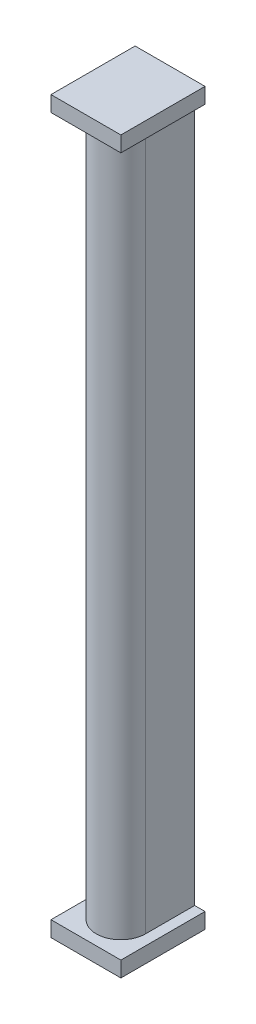
ISO-10303-21;
HEADER;
FILE_DESCRIPTION(('STEP AP214'),'2;1');
FILE_NAME('part.step','',(''),(''),'','','');
FILE_SCHEMA(('AUTOMOTIVE_DESIGN { 1 0 10303 214 1 1 1 1 }'));
ENDSEC;
DATA;
#1=APPLICATION_CONTEXT('core data for automotive mechanical design processes');
#2=APPLICATION_PROTOCOL_DEFINITION('international standard','automotive_design',2000,#1);
#3=PRODUCT_CONTEXT('',#1,'mechanical');
#4=PRODUCT('Part','Part','',(#3));
#5=PRODUCT_RELATED_PRODUCT_CATEGORY('part','',(#4));
#6=PRODUCT_DEFINITION_FORMATION('','',#4);
#7=PRODUCT_DEFINITION_CONTEXT('part definition',#1,'design');
#8=PRODUCT_DEFINITION('design','',#6,#7);
#9=PRODUCT_DEFINITION_SHAPE('','',#8);
#10=(LENGTH_UNIT() NAMED_UNIT(*) SI_UNIT(.MILLI.,.METRE.));
#11=(NAMED_UNIT(*) PLANE_ANGLE_UNIT() SI_UNIT($,.RADIAN.));
#12=(NAMED_UNIT(*) SI_UNIT($,.STERADIAN.) SOLID_ANGLE_UNIT());
#13=UNCERTAINTY_MEASURE_WITH_UNIT(LENGTH_MEASURE(1.E-05),#10,'distance_accuracy_value','');
#14=(GEOMETRIC_REPRESENTATION_CONTEXT(3) GLOBAL_UNCERTAINTY_ASSIGNED_CONTEXT((#13)) GLOBAL_UNIT_ASSIGNED_CONTEXT((#10,
#11,#12)) REPRESENTATION_CONTEXT('',''));
#15=CARTESIAN_POINT('',(0.,0.,0.));
#16=DIRECTION('',(0.,0.,1.));
#17=DIRECTION('',(1.,0.,0.));
#18=AXIS2_PLACEMENT_3D('',#15,#16,#17);
#19=CARTESIAN_POINT('',(0.,-135.,0.));
#20=DIRECTION('',(-1.,0.,0.));
#21=DIRECTION('',(0.,0.,1.));
#22=AXIS2_PLACEMENT_3D('',#19,#20,#21);
#23=PLANE('',#22);
#24=DIRECTION('',(0.,0.,1.));
#25=VECTOR('',#24,1.);
#26=CARTESIAN_POINT('',(0.,0.,0.));
#27=LINE('',#26,#25);
#28=CARTESIAN_POINT('',(0.,0.,0.));
#29=VERTEX_POINT('',#28);
#30=CARTESIAN_POINT('',(0.,0.,9.5));
#31=VERTEX_POINT('',#30);
#32=EDGE_CURVE('E88',#29,#31,#27,.T.);
#33=ORIENTED_EDGE('',*,*,#32,.F.);
#34=DIRECTION('',(0.,1.,0.));
#35=VECTOR('',#34,1.);
#36=CARTESIAN_POINT('',(0.,-135.,0.));
#37=LINE('',#36,#35);
#38=CARTESIAN_POINT('',(0.,-135.,0.));
#39=VERTEX_POINT('',#38);
#40=EDGE_CURVE('E11',#39,#29,#37,.T.);
#41=ORIENTED_EDGE('',*,*,#40,.F.);
#42=DIRECTION('',(0.,0.,1.));
#43=VECTOR('',#42,1.);
#44=CARTESIAN_POINT('',(0.,-135.,0.));
#45=LINE('',#44,#43);
#46=CARTESIAN_POINT('',(0.,-135.,9.5));
#47=VERTEX_POINT('',#46);
#48=EDGE_CURVE('E83',#39,#47,#45,.T.);
#49=ORIENTED_EDGE('',*,*,#48,.T.);
#50=DIRECTION('',(0.,1.,0.));
#51=VECTOR('',#50,1.);
#52=CARTESIAN_POINT('',(0.,-135.,9.5));
#53=LINE('',#52,#51);
#54=EDGE_CURVE('E72',#47,#31,#53,.T.);
#55=ORIENTED_EDGE('',*,*,#54,.T.);
#56=EDGE_LOOP('',(#33,#41,#49,#55));
#57=FACE_BOUND('',#56,.T.);
#58=ADVANCED_FACE('F33',(#57),#23,.T.);
#59=CARTESIAN_POINT('',(0.,-135.,0.));
#60=DIRECTION('',(0.,0.,-1.));
#61=DIRECTION('',(-1.,0.,0.));
#62=AXIS2_PLACEMENT_3D('',#59,#60,#61);
#63=PLANE('',#62);
#64=ORIENTED_EDGE('',*,*,#40,.T.);
#65=DIRECTION('',(-1.,0.,0.));
#66=VECTOR('',#65,1.);
#67=CARTESIAN_POINT('',(-2.,0.,0.));
#68=LINE('',#67,#66);
#69=CARTESIAN_POINT('',(-2.,0.,0.));
#70=VERTEX_POINT('',#69);
#71=EDGE_CURVE('E202',#29,#70,#68,.T.);
#72=ORIENTED_EDGE('',*,*,#71,.T.);
#73=DIRECTION('',(0.,-1.,0.));
#74=VECTOR('',#73,1.);
#75=CARTESIAN_POINT('',(-2.,3.,0.));
#76=LINE('',#75,#74);
#77=CARTESIAN_POINT('',(-2.,3.,0.));
#78=VERTEX_POINT('',#77);
#79=EDGE_CURVE('E209',#78,#70,#76,.T.);
#80=ORIENTED_EDGE('',*,*,#79,.F.);
#81=DIRECTION('',(-1.,0.,0.));
#82=VECTOR('',#81,1.);
#83=CARTESIAN_POINT('',(-2.,3.,0.));
#84=LINE('',#83,#82);
#85=CARTESIAN_POINT('',(11.5,3.,0.));
#86=VERTEX_POINT('',#85);
#87=EDGE_CURVE('E183',#86,#78,#84,.T.);
#88=ORIENTED_EDGE('',*,*,#87,.F.);
#89=DIRECTION('',(0.,-1.,0.));
#90=VECTOR('',#89,1.);
#91=CARTESIAN_POINT('',(11.5,3.,0.));
#92=LINE('',#91,#90);
#93=CARTESIAN_POINT('',(11.5,0.,0.));
#94=VERTEX_POINT('',#93);
#95=EDGE_CURVE('E196',#86,#94,#92,.T.);
#96=ORIENTED_EDGE('',*,*,#95,.T.);
#97=CARTESIAN_POINT('',(9.5,0.,0.));
#98=VERTEX_POINT('',#97);
#99=EDGE_CURVE('E187',#94,#98,#68,.T.);
#100=ORIENTED_EDGE('',*,*,#99,.T.);
#101=DIRECTION('',(0.,1.,0.));
#102=VECTOR('',#101,1.);
#103=CARTESIAN_POINT('',(9.5,-135.,0.));
#104=LINE('',#103,#102);
#105=CARTESIAN_POINT('',(9.5,-135.,0.));
#106=VERTEX_POINT('',#105);
#107=EDGE_CURVE('E42',#106,#98,#104,.T.);
#108=ORIENTED_EDGE('',*,*,#107,.F.);
#109=DIRECTION('',(1.,0.,0.));
#110=VECTOR('',#109,1.);
#111=CARTESIAN_POINT('',(-2.,-135.,0.));
#112=LINE('',#111,#110);
#113=CARTESIAN_POINT('',(11.5,-135.,0.));
#114=VERTEX_POINT('',#113);
#115=EDGE_CURVE('E114',#106,#114,#112,.T.);
#116=ORIENTED_EDGE('',*,*,#115,.T.);
#117=DIRECTION('',(0.,1.,0.));
#118=VECTOR('',#117,1.);
#119=CARTESIAN_POINT('',(11.5,-138.,0.));
#120=LINE('',#119,#118);
#121=CARTESIAN_POINT('',(11.5,-138.,0.));
#122=VERTEX_POINT('',#121);
#123=EDGE_CURVE('E273',#122,#114,#120,.T.);
#124=ORIENTED_EDGE('',*,*,#123,.F.);
#125=DIRECTION('',(1.,0.,0.));
#126=VECTOR('',#125,1.);
#127=CARTESIAN_POINT('',(-2.,-138.,0.));
#128=LINE('',#127,#126);
#129=CARTESIAN_POINT('',(-2.,-138.,0.));
#130=VERTEX_POINT('',#129);
#131=EDGE_CURVE('E287',#130,#122,#128,.T.);
#132=ORIENTED_EDGE('',*,*,#131,.F.);
#133=DIRECTION('',(0.,1.,0.));
#134=VECTOR('',#133,1.);
#135=CARTESIAN_POINT('',(-2.,-138.,0.));
#136=LINE('',#135,#134);
#137=CARTESIAN_POINT('',(-2.,-135.,0.));
#138=VERTEX_POINT('',#137);
#139=EDGE_CURVE('E90',#130,#138,#136,.T.);
#140=ORIENTED_EDGE('',*,*,#139,.T.);
#141=EDGE_CURVE('E276',#138,#39,#112,.T.);
#142=ORIENTED_EDGE('',*,*,#141,.T.);
#143=EDGE_LOOP('',(#64,#72,#80,#88,#96,#100,#108,#116,#124,#132,#140,#142));
#144=FACE_BOUND('',#143,.T.);
#145=ADVANCED_FACE('F214',(#144),#63,.T.);
#146=CARTESIAN_POINT('',(9.5,-135.,0.));
#147=DIRECTION('',(1.,0.,0.));
#148=DIRECTION('',(0.,0.,-1.));
#149=AXIS2_PLACEMENT_3D('',#146,#147,#148);
#150=PLANE('',#149);
#151=DIRECTION('',(0.,0.,-1.));
#152=VECTOR('',#151,1.);
#153=CARTESIAN_POINT('',(9.5,0.,0.));
#154=LINE('',#153,#152);
#155=CARTESIAN_POINT('',(9.5,0.,9.5));
#156=VERTEX_POINT('',#155);
#157=EDGE_CURVE('E76',#156,#98,#154,.T.);
#158=ORIENTED_EDGE('',*,*,#157,.F.);
#159=DIRECTION('',(0.,1.,0.));
#160=VECTOR('',#159,1.);
#161=CARTESIAN_POINT('',(9.5,-135.,9.5));
#162=LINE('',#161,#160);
#163=CARTESIAN_POINT('',(9.5,-135.,9.5));
#164=VERTEX_POINT('',#163);
#165=EDGE_CURVE('E63',#164,#156,#162,.T.);
#166=ORIENTED_EDGE('',*,*,#165,.F.);
#167=DIRECTION('',(0.,0.,-1.));
#168=VECTOR('',#167,1.);
#169=CARTESIAN_POINT('',(9.5,-135.,0.));
#170=LINE('',#169,#168);
#171=EDGE_CURVE('E50',#164,#106,#170,.T.);
#172=ORIENTED_EDGE('',*,*,#171,.T.);
#173=ORIENTED_EDGE('',*,*,#107,.T.);
#174=EDGE_LOOP('',(#158,#166,#172,#173));
#175=FACE_BOUND('',#174,.T.);
#176=ADVANCED_FACE('F77',(#175),#150,.T.);
#177=CARTESIAN_POINT('',(4.75,-135.,9.5));
#178=DIRECTION('',(0.,1.,0.));
#179=DIRECTION('',(0.,0.,1.));
#180=AXIS2_PLACEMENT_3D('',#177,#178,#179);
#181=CYLINDRICAL_SURFACE('',#180,4.75);
#182=CARTESIAN_POINT('',(4.75,0.,9.5));
#183=DIRECTION('',(0.,1.,0.));
#184=DIRECTION('',(0.,0.,1.));
#185=AXIS2_PLACEMENT_3D('',#182,#183,#184);
#186=CIRCLE('',#185,4.75);
#187=EDGE_CURVE('E68',#31,#156,#186,.T.);
#188=ORIENTED_EDGE('',*,*,#187,.F.);
#189=ORIENTED_EDGE('',*,*,#54,.F.);
#190=CARTESIAN_POINT('',(4.75,-135.,9.5));
#191=DIRECTION('',(0.,1.,0.));
#192=DIRECTION('',(0.,0.,1.));
#193=AXIS2_PLACEMENT_3D('',#190,#191,#192);
#194=CIRCLE('',#193,4.75);
#195=EDGE_CURVE('E70',#47,#164,#194,.T.);
#196=ORIENTED_EDGE('',*,*,#195,.T.);
#197=ORIENTED_EDGE('',*,*,#165,.T.);
#198=EDGE_LOOP('',(#188,#189,#196,#197));
#199=FACE_BOUND('',#198,.T.);
#200=ADVANCED_FACE('F65',(#199),#181,.T.);
#201=CARTESIAN_POINT('',(0.,-135.,0.));
#202=DIRECTION('',(0.,1.,0.));
#203=DIRECTION('',(0.,0.,1.));
#204=AXIS2_PLACEMENT_3D('',#201,#202,#203);
#205=PLANE('',#204);
#206=ORIENTED_EDGE('',*,*,#48,.F.);
#207=ORIENTED_EDGE('',*,*,#141,.F.);
#208=DIRECTION('',(0.,0.,-1.));
#209=VECTOR('',#208,1.);
#210=CARTESIAN_POINT('',(-2.,-135.,0.));
#211=LINE('',#210,#209);
#212=CARTESIAN_POINT('',(-2.,-135.,16.25));
#213=VERTEX_POINT('',#212);
#214=EDGE_CURVE('E192',#213,#138,#211,.T.);
#215=ORIENTED_EDGE('',*,*,#214,.F.);
#216=DIRECTION('',(-1.,0.,0.));
#217=VECTOR('',#216,1.);
#218=CARTESIAN_POINT('',(-2.,-135.,16.25));
#219=LINE('',#218,#217);
#220=CARTESIAN_POINT('',(11.5,-135.,16.25));
#221=VERTEX_POINT('',#220);
#222=EDGE_CURVE('E275',#221,#213,#219,.T.);
#223=ORIENTED_EDGE('',*,*,#222,.F.);
#224=DIRECTION('',(0.,0.,1.));
#225=VECTOR('',#224,1.);
#226=CARTESIAN_POINT('',(11.5,-135.,0.));
#227=LINE('',#226,#225);
#228=EDGE_CURVE('E267',#114,#221,#227,.T.);
#229=ORIENTED_EDGE('',*,*,#228,.F.);
#230=ORIENTED_EDGE('',*,*,#115,.F.);
#231=ORIENTED_EDGE('',*,*,#171,.F.);
#232=ORIENTED_EDGE('',*,*,#195,.F.);
#233=EDGE_LOOP('',(#206,#207,#215,#223,#229,#230,#231,#232));
#234=FACE_BOUND('',#233,.T.);
#235=ADVANCED_FACE('F244',(#234),#205,.T.);
#236=CARTESIAN_POINT('',(-2.,-138.,0.));
#237=DIRECTION('',(1.,0.,0.));
#238=DIRECTION('',(0.,0.,-1.));
#239=AXIS2_PLACEMENT_3D('',#236,#237,#238);
#240=PLANE('',#239);
#241=ORIENTED_EDGE('',*,*,#214,.T.);
#242=ORIENTED_EDGE('',*,*,#139,.F.);
#243=DIRECTION('',(0.,0.,-1.));
#244=VECTOR('',#243,1.);
#245=CARTESIAN_POINT('',(-2.,-138.,0.));
#246=LINE('',#245,#244);
#247=CARTESIAN_POINT('',(-2.,-138.,16.25));
#248=VERTEX_POINT('',#247);
#249=EDGE_CURVE('E284',#248,#130,#246,.T.);
#250=ORIENTED_EDGE('',*,*,#249,.F.);
#251=DIRECTION('',(0.,1.,0.));
#252=VECTOR('',#251,1.);
#253=CARTESIAN_POINT('',(-2.,-138.,16.25));
#254=LINE('',#253,#252);
#255=EDGE_CURVE('E281',#248,#213,#254,.T.);
#256=ORIENTED_EDGE('',*,*,#255,.T.);
#257=EDGE_LOOP('',(#241,#242,#250,#256));
#258=FACE_BOUND('',#257,.T.);
#259=ADVANCED_FACE('F241',(#258),#240,.F.);
#260=CARTESIAN_POINT('',(11.5,-138.,0.));
#261=DIRECTION('',(-1.,0.,0.));
#262=DIRECTION('',(0.,0.,1.));
#263=AXIS2_PLACEMENT_3D('',#260,#261,#262);
#264=PLANE('',#263);
#265=ORIENTED_EDGE('',*,*,#228,.T.);
#266=DIRECTION('',(0.,1.,0.));
#267=VECTOR('',#266,1.);
#268=CARTESIAN_POINT('',(11.5,-138.,16.25));
#269=LINE('',#268,#267);
#270=CARTESIAN_POINT('',(11.5,-138.,16.25));
#271=VERTEX_POINT('',#270);
#272=EDGE_CURVE('E270',#271,#221,#269,.T.);
#273=ORIENTED_EDGE('',*,*,#272,.F.);
#274=DIRECTION('',(0.,0.,1.));
#275=VECTOR('',#274,1.);
#276=CARTESIAN_POINT('',(11.5,-138.,0.));
#277=LINE('',#276,#275);
#278=EDGE_CURVE('E300',#122,#271,#277,.T.);
#279=ORIENTED_EDGE('',*,*,#278,.F.);
#280=ORIENTED_EDGE('',*,*,#123,.T.);
#281=EDGE_LOOP('',(#265,#273,#279,#280));
#282=FACE_BOUND('',#281,.T.);
#283=ADVANCED_FACE('F252',(#282),#264,.F.);
#284=CARTESIAN_POINT('',(-2.,-138.,16.25));
#285=DIRECTION('',(0.,0.,-1.));
#286=DIRECTION('',(-1.,0.,0.));
#287=AXIS2_PLACEMENT_3D('',#284,#285,#286);
#288=PLANE('',#287);
#289=ORIENTED_EDGE('',*,*,#222,.T.);
#290=ORIENTED_EDGE('',*,*,#255,.F.);
#291=DIRECTION('',(-1.,0.,0.));
#292=VECTOR('',#291,1.);
#293=CARTESIAN_POINT('',(-2.,-138.,16.25));
#294=LINE('',#293,#292);
#295=EDGE_CURVE('E280',#271,#248,#294,.T.);
#296=ORIENTED_EDGE('',*,*,#295,.F.);
#297=ORIENTED_EDGE('',*,*,#272,.T.);
#298=EDGE_LOOP('',(#289,#290,#296,#297));
#299=FACE_BOUND('',#298,.T.);
#300=ADVANCED_FACE('F258',(#299),#288,.F.);
#301=CARTESIAN_POINT('',(0.,-138.,0.));
#302=DIRECTION('',(0.,1.,0.));
#303=DIRECTION('',(0.,0.,1.));
#304=AXIS2_PLACEMENT_3D('',#301,#302,#303);
#305=PLANE('',#304);
#306=ORIENTED_EDGE('',*,*,#249,.T.);
#307=ORIENTED_EDGE('',*,*,#131,.T.);
#308=ORIENTED_EDGE('',*,*,#278,.T.);
#309=ORIENTED_EDGE('',*,*,#295,.T.);
#310=EDGE_LOOP('',(#306,#307,#308,#309));
#311=FACE_BOUND('',#310,.T.);
#312=ADVANCED_FACE('F256',(#311),#305,.F.);
#313=CARTESIAN_POINT('',(0.,0.,0.));
#314=DIRECTION('',(0.,1.,0.));
#315=DIRECTION('',(0.,0.,1.));
#316=AXIS2_PLACEMENT_3D('',#313,#314,#315);
#317=PLANE('',#316);
#318=ORIENTED_EDGE('',*,*,#71,.F.);
#319=ORIENTED_EDGE('',*,*,#32,.T.);
#320=ORIENTED_EDGE('',*,*,#187,.T.);
#321=ORIENTED_EDGE('',*,*,#157,.T.);
#322=ORIENTED_EDGE('',*,*,#99,.F.);
#323=DIRECTION('',(0.,0.,-1.));
#324=VECTOR('',#323,1.);
#325=CARTESIAN_POINT('',(11.5,0.,0.));
#326=LINE('',#325,#324);
#327=CARTESIAN_POINT('',(11.5,0.,16.25));
#328=VERTEX_POINT('',#327);
#329=EDGE_CURVE('E207',#328,#94,#326,.T.);
#330=ORIENTED_EDGE('',*,*,#329,.F.);
#331=DIRECTION('',(1.,0.,0.));
#332=VECTOR('',#331,1.);
#333=CARTESIAN_POINT('',(-2.,0.,16.25));
#334=LINE('',#333,#332);
#335=CARTESIAN_POINT('',(-2.,0.,16.25));
#336=VERTEX_POINT('',#335);
#337=EDGE_CURVE('E217',#336,#328,#334,.T.);
#338=ORIENTED_EDGE('',*,*,#337,.F.);
#339=DIRECTION('',(0.,0.,1.));
#340=VECTOR('',#339,1.);
#341=CARTESIAN_POINT('',(-2.,0.,0.));
#342=LINE('',#341,#340);
#343=EDGE_CURVE('E191',#70,#336,#342,.T.);
#344=ORIENTED_EDGE('',*,*,#343,.F.);
#345=EDGE_LOOP('',(#318,#319,#320,#321,#322,#330,#338,#344));
#346=FACE_BOUND('',#345,.T.);
#347=ADVANCED_FACE('F86',(#346),#317,.F.);
#348=CARTESIAN_POINT('',(-2.,3.,0.));
#349=DIRECTION('',(1.,0.,0.));
#350=DIRECTION('',(0.,0.,-1.));
#351=AXIS2_PLACEMENT_3D('',#348,#349,#350);
#352=PLANE('',#351);
#353=ORIENTED_EDGE('',*,*,#343,.T.);
#354=DIRECTION('',(0.,-1.,0.));
#355=VECTOR('',#354,1.);
#356=CARTESIAN_POINT('',(-2.,3.,16.25));
#357=LINE('',#356,#355);
#358=CARTESIAN_POINT('',(-2.,3.,16.25));
#359=VERTEX_POINT('',#358);
#360=EDGE_CURVE('E171',#359,#336,#357,.T.);
#361=ORIENTED_EDGE('',*,*,#360,.F.);
#362=DIRECTION('',(0.,0.,1.));
#363=VECTOR('',#362,1.);
#364=CARTESIAN_POINT('',(-2.,3.,0.));
#365=LINE('',#364,#363);
#366=EDGE_CURVE('E178',#78,#359,#365,.T.);
#367=ORIENTED_EDGE('',*,*,#366,.F.);
#368=ORIENTED_EDGE('',*,*,#79,.T.);
#369=EDGE_LOOP('',(#353,#361,#367,#368));
#370=FACE_BOUND('',#369,.T.);
#371=ADVANCED_FACE('F189',(#370),#352,.F.);
#372=CARTESIAN_POINT('',(-2.,3.,16.25));
#373=DIRECTION('',(0.,0.,-1.));
#374=DIRECTION('',(-1.,0.,0.));
#375=AXIS2_PLACEMENT_3D('',#372,#373,#374);
#376=PLANE('',#375);
#377=ORIENTED_EDGE('',*,*,#337,.T.);
#378=DIRECTION('',(0.,-1.,0.));
#379=VECTOR('',#378,1.);
#380=CARTESIAN_POINT('',(11.5,3.,16.25));
#381=LINE('',#380,#379);
#382=CARTESIAN_POINT('',(11.5,3.,16.25));
#383=VERTEX_POINT('',#382);
#384=EDGE_CURVE('E174',#383,#328,#381,.T.);
#385=ORIENTED_EDGE('',*,*,#384,.F.);
#386=DIRECTION('',(1.,0.,0.));
#387=VECTOR('',#386,1.);
#388=CARTESIAN_POINT('',(-2.,3.,16.25));
#389=LINE('',#388,#387);
#390=EDGE_CURVE('E167',#359,#383,#389,.T.);
#391=ORIENTED_EDGE('',*,*,#390,.F.);
#392=ORIENTED_EDGE('',*,*,#360,.T.);
#393=EDGE_LOOP('',(#377,#385,#391,#392));
#394=FACE_BOUND('',#393,.T.);
#395=ADVANCED_FACE('F169',(#394),#376,.F.);
#396=CARTESIAN_POINT('',(11.5,3.,0.));
#397=DIRECTION('',(-1.,0.,0.));
#398=DIRECTION('',(0.,0.,1.));
#399=AXIS2_PLACEMENT_3D('',#396,#397,#398);
#400=PLANE('',#399);
#401=ORIENTED_EDGE('',*,*,#329,.T.);
#402=ORIENTED_EDGE('',*,*,#95,.F.);
#403=DIRECTION('',(0.,0.,-1.));
#404=VECTOR('',#403,1.);
#405=CARTESIAN_POINT('',(11.5,3.,0.));
#406=LINE('',#405,#404);
#407=EDGE_CURVE('E177',#383,#86,#406,.T.);
#408=ORIENTED_EDGE('',*,*,#407,.F.);
#409=ORIENTED_EDGE('',*,*,#384,.T.);
#410=EDGE_LOOP('',(#401,#402,#408,#409));
#411=FACE_BOUND('',#410,.T.);
#412=ADVANCED_FACE('F221',(#411),#400,.F.);
#413=CARTESIAN_POINT('',(0.,3.,0.));
#414=DIRECTION('',(0.,1.,0.));
#415=DIRECTION('',(0.,0.,1.));
#416=AXIS2_PLACEMENT_3D('',#413,#414,#415);
#417=PLANE('',#416);
#418=ORIENTED_EDGE('',*,*,#366,.T.);
#419=ORIENTED_EDGE('',*,*,#390,.T.);
#420=ORIENTED_EDGE('',*,*,#407,.T.);
#421=ORIENTED_EDGE('',*,*,#87,.T.);
#422=EDGE_LOOP('',(#418,#419,#420,#421));
#423=FACE_BOUND('',#422,.T.);
#424=ADVANCED_FACE('F181',(#423),#417,.T.);
#425=CLOSED_SHELL('',(#58,#145,#176,#200,#235,#259,#283,#300,#312,#347,#371,#395,#412,#424));
#426=MANIFOLD_SOLID_BREP('B2',#425);
#427=ADVANCED_BREP_SHAPE_REPRESENTATION('',(#18,#426),#14);
#428=SHAPE_DEFINITION_REPRESENTATION(#9,#427);
ENDSEC;
END-ISO-10303-21;
